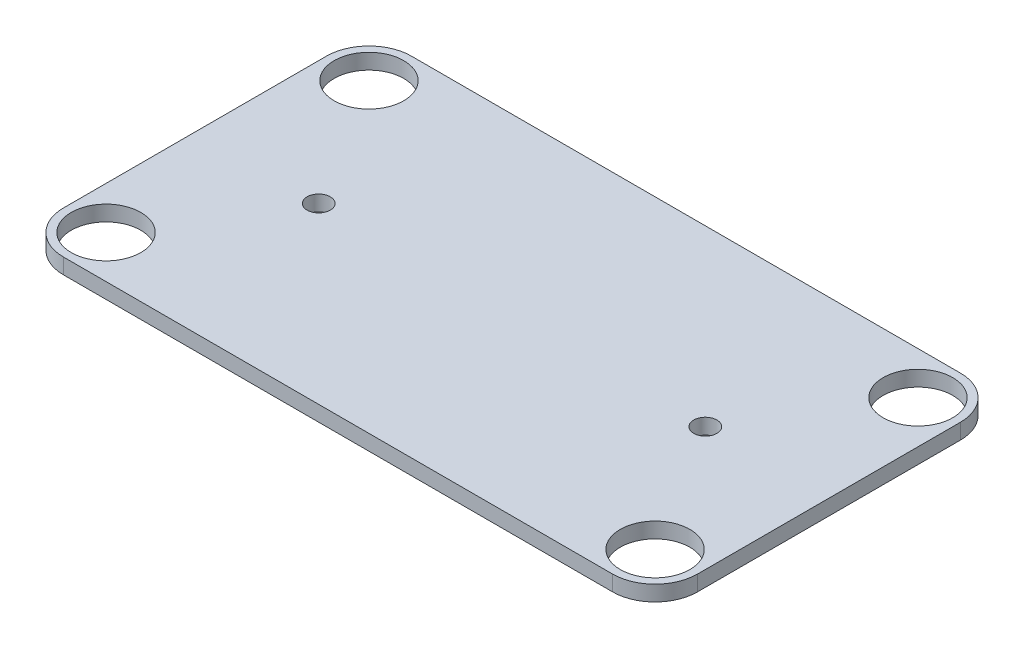
ISO-10303-21;
HEADER;
FILE_DESCRIPTION(('STEP AP214'),'2;1');
FILE_NAME('part.step','',(''),(''),'','','');
FILE_SCHEMA(('AUTOMOTIVE_DESIGN { 1 0 10303 214 1 1 1 1 }'));
ENDSEC;
DATA;
#1=APPLICATION_CONTEXT('core data for automotive mechanical design processes');
#2=APPLICATION_PROTOCOL_DEFINITION('international standard','automotive_design',2000,#1);
#3=PRODUCT_CONTEXT('',#1,'mechanical');
#4=PRODUCT('Part','Part','',(#3));
#5=PRODUCT_RELATED_PRODUCT_CATEGORY('part','',(#4));
#6=PRODUCT_DEFINITION_FORMATION('','',#4);
#7=PRODUCT_DEFINITION_CONTEXT('part definition',#1,'design');
#8=PRODUCT_DEFINITION('design','',#6,#7);
#9=PRODUCT_DEFINITION_SHAPE('','',#8);
#10=(LENGTH_UNIT() NAMED_UNIT(*) SI_UNIT(.MILLI.,.METRE.));
#11=(NAMED_UNIT(*) PLANE_ANGLE_UNIT() SI_UNIT($,.RADIAN.));
#12=(NAMED_UNIT(*) SI_UNIT($,.STERADIAN.) SOLID_ANGLE_UNIT());
#13=UNCERTAINTY_MEASURE_WITH_UNIT(LENGTH_MEASURE(1.E-05),#10,'distance_accuracy_value','');
#14=(GEOMETRIC_REPRESENTATION_CONTEXT(3) GLOBAL_UNCERTAINTY_ASSIGNED_CONTEXT((#13)) GLOBAL_UNIT_ASSIGNED_CONTEXT((#10,
#11,#12)) REPRESENTATION_CONTEXT('',''));
#15=CARTESIAN_POINT('',(0.,0.,0.));
#16=DIRECTION('',(0.,0.,1.));
#17=DIRECTION('',(1.,0.,0.));
#18=AXIS2_PLACEMENT_3D('',#15,#16,#17);
#19=CARTESIAN_POINT('',(-41.,2.,22.5));
#20=DIRECTION('',(0.,1.,0.));
#21=DIRECTION('',(0.,0.,1.));
#22=AXIS2_PLACEMENT_3D('',#19,#20,#21);
#23=PLANE('',#22);
#24=CARTESIAN_POINT('',(-25.,2.,0.));
#25=DIRECTION('',(0.,1.,0.));
#26=DIRECTION('',(0.,0.,1.));
#27=AXIS2_PLACEMENT_3D('',#24,#25,#26);
#28=CIRCLE('',#27,1.5);
#29=CARTESIAN_POINT('',(-25.,2.,1.5));
#30=VERTEX_POINT('',#29);
#31=EDGE_CURVE('E198',#30,#30,#28,.T.);
#32=ORIENTED_EDGE('',*,*,#31,.F.);
#33=EDGE_LOOP('',(#32));
#34=FACE_BOUND('',#33,.T.);
#35=CARTESIAN_POINT('',(35.5,2.,17.));
#36=DIRECTION('',(0.,1.,0.));
#37=DIRECTION('',(0.,0.,1.));
#38=AXIS2_PLACEMENT_3D('',#35,#36,#37);
#39=CIRCLE('',#38,4.5);
#40=CARTESIAN_POINT('',(35.5,2.,21.5));
#41=VERTEX_POINT('',#40);
#42=EDGE_CURVE('E186',#41,#41,#39,.T.);
#43=ORIENTED_EDGE('',*,*,#42,.F.);
#44=EDGE_LOOP('',(#43));
#45=FACE_BOUND('',#44,.T.);
#46=CARTESIAN_POINT('',(-35.5,2.,-17.));
#47=DIRECTION('',(0.,1.,0.));
#48=DIRECTION('',(0.,0.,1.));
#49=AXIS2_PLACEMENT_3D('',#46,#47,#48);
#50=CIRCLE('',#49,4.5);
#51=CARTESIAN_POINT('',(-35.5,2.,-12.5));
#52=VERTEX_POINT('',#51);
#53=EDGE_CURVE('E127',#52,#52,#50,.T.);
#54=ORIENTED_EDGE('',*,*,#53,.F.);
#55=EDGE_LOOP('',(#54));
#56=FACE_BOUND('',#55,.T.);
#57=DIRECTION('',(-1.,0.,0.));
#58=VECTOR('',#57,1.);
#59=CARTESIAN_POINT('',(-41.,2.,-22.5));
#60=LINE('',#59,#58);
#61=CARTESIAN_POINT('',(35.5,2.,-22.5));
#62=VERTEX_POINT('',#61);
#63=CARTESIAN_POINT('',(-35.5,2.,-22.5));
#64=VERTEX_POINT('',#63);
#65=EDGE_CURVE('E136',#62,#64,#60,.T.);
#66=ORIENTED_EDGE('',*,*,#65,.T.);
#67=CARTESIAN_POINT('',(-35.5,2.,-17.));
#68=DIRECTION('',(0.,1.,0.));
#69=DIRECTION('',(0.,0.,1.));
#70=AXIS2_PLACEMENT_3D('',#67,#68,#69);
#71=CIRCLE('',#70,5.5);
#72=CARTESIAN_POINT('',(-41.,2.,-17.));
#73=VERTEX_POINT('',#72);
#74=EDGE_CURVE('E155',#64,#73,#71,.T.);
#75=ORIENTED_EDGE('',*,*,#74,.T.);
#76=DIRECTION('',(0.,0.,1.));
#77=VECTOR('',#76,1.);
#78=CARTESIAN_POINT('',(-41.,2.,-22.5));
#79=LINE('',#78,#77);
#80=CARTESIAN_POINT('',(-41.,2.,17.));
#81=VERTEX_POINT('',#80);
#82=EDGE_CURVE('E119',#73,#81,#79,.T.);
#83=ORIENTED_EDGE('',*,*,#82,.T.);
#84=CARTESIAN_POINT('',(-35.5,2.,17.));
#85=DIRECTION('',(0.,1.,0.));
#86=DIRECTION('',(0.,0.,1.));
#87=AXIS2_PLACEMENT_3D('',#84,#85,#86);
#88=CIRCLE('',#87,5.5);
#89=CARTESIAN_POINT('',(-35.5,2.,22.5));
#90=VERTEX_POINT('',#89);
#91=EDGE_CURVE('E150',#81,#90,#88,.T.);
#92=ORIENTED_EDGE('',*,*,#91,.T.);
#93=DIRECTION('',(1.,0.,0.));
#94=VECTOR('',#93,1.);
#95=CARTESIAN_POINT('',(-41.,2.,22.5));
#96=LINE('',#95,#94);
#97=CARTESIAN_POINT('',(35.5,2.,22.5));
#98=VERTEX_POINT('',#97);
#99=EDGE_CURVE('E166',#90,#98,#96,.T.);
#100=ORIENTED_EDGE('',*,*,#99,.T.);
#101=CARTESIAN_POINT('',(35.5,2.,17.));
#102=DIRECTION('',(0.,1.,0.));
#103=DIRECTION('',(0.,0.,1.));
#104=AXIS2_PLACEMENT_3D('',#101,#102,#103);
#105=CIRCLE('',#104,5.5);
#106=CARTESIAN_POINT('',(41.,2.,17.));
#107=VERTEX_POINT('',#106);
#108=EDGE_CURVE('E55',#98,#107,#105,.T.);
#109=ORIENTED_EDGE('',*,*,#108,.T.);
#110=DIRECTION('',(0.,0.,-1.));
#111=VECTOR('',#110,1.);
#112=CARTESIAN_POINT('',(41.,2.,-22.5));
#113=LINE('',#112,#111);
#114=CARTESIAN_POINT('',(41.,2.,-17.));
#115=VERTEX_POINT('',#114);
#116=EDGE_CURVE('E174',#107,#115,#113,.T.);
#117=ORIENTED_EDGE('',*,*,#116,.T.);
#118=CARTESIAN_POINT('',(35.5,2.,-17.));
#119=DIRECTION('',(0.,1.,0.));
#120=DIRECTION('',(0.,0.,1.));
#121=AXIS2_PLACEMENT_3D('',#118,#119,#120);
#122=CIRCLE('',#121,5.5);
#123=EDGE_CURVE('E153',#115,#62,#122,.T.);
#124=ORIENTED_EDGE('',*,*,#123,.T.);
#125=EDGE_LOOP('',(#66,#75,#83,#92,#100,#109,#117,#124));
#126=FACE_BOUND('',#125,.T.);
#127=CARTESIAN_POINT('',(35.5,2.,-17.));
#128=DIRECTION('',(0.,1.,0.));
#129=DIRECTION('',(0.,0.,1.));
#130=AXIS2_PLACEMENT_3D('',#127,#128,#129);
#131=CIRCLE('',#130,4.5);
#132=CARTESIAN_POINT('',(35.5,2.,-12.5));
#133=VERTEX_POINT('',#132);
#134=EDGE_CURVE('E181',#133,#133,#131,.T.);
#135=ORIENTED_EDGE('',*,*,#134,.F.);
#136=EDGE_LOOP('',(#135));
#137=FACE_BOUND('',#136,.T.);
#138=CARTESIAN_POINT('',(-35.5,2.,17.));
#139=DIRECTION('',(0.,1.,0.));
#140=DIRECTION('',(0.,0.,1.));
#141=AXIS2_PLACEMENT_3D('',#138,#139,#140);
#142=CIRCLE('',#141,4.5);
#143=CARTESIAN_POINT('',(-35.5,2.,21.5));
#144=VERTEX_POINT('',#143);
#145=EDGE_CURVE('E192',#144,#144,#142,.T.);
#146=ORIENTED_EDGE('',*,*,#145,.F.);
#147=EDGE_LOOP('',(#146));
#148=FACE_BOUND('',#147,.T.);
#149=CARTESIAN_POINT('',(25.,2.,0.));
#150=DIRECTION('',(0.,1.,0.));
#151=DIRECTION('',(0.,0.,1.));
#152=AXIS2_PLACEMENT_3D('',#149,#150,#151);
#153=CIRCLE('',#152,1.5);
#154=CARTESIAN_POINT('',(25.,2.,1.5));
#155=VERTEX_POINT('',#154);
#156=EDGE_CURVE('E204',#155,#155,#153,.T.);
#157=ORIENTED_EDGE('',*,*,#156,.F.);
#158=EDGE_LOOP('',(#157));
#159=FACE_BOUND('',#158,.T.);
#160=ADVANCED_FACE('F33',(#34,#45,#56,#126,#137,#148,#159),#23,.T.);
#161=CARTESIAN_POINT('',(-41.,0.,22.5));
#162=DIRECTION('',(0.,1.,0.));
#163=DIRECTION('',(0.,0.,1.));
#164=AXIS2_PLACEMENT_3D('',#161,#162,#163);
#165=PLANE('',#164);
#166=CARTESIAN_POINT('',(-25.,0.,0.));
#167=DIRECTION('',(0.,1.,0.));
#168=DIRECTION('',(0.,0.,1.));
#169=AXIS2_PLACEMENT_3D('',#166,#167,#168);
#170=CIRCLE('',#169,1.5);
#171=CARTESIAN_POINT('',(-25.,0.,1.5));
#172=VERTEX_POINT('',#171);
#173=EDGE_CURVE('E201',#172,#172,#170,.T.);
#174=ORIENTED_EDGE('',*,*,#173,.T.);
#175=EDGE_LOOP('',(#174));
#176=FACE_BOUND('',#175,.T.);
#177=CARTESIAN_POINT('',(35.5,0.,17.));
#178=DIRECTION('',(0.,1.,0.));
#179=DIRECTION('',(0.,0.,1.));
#180=AXIS2_PLACEMENT_3D('',#177,#178,#179);
#181=CIRCLE('',#180,4.5);
#182=CARTESIAN_POINT('',(35.5,0.,21.5));
#183=VERTEX_POINT('',#182);
#184=EDGE_CURVE('E189',#183,#183,#181,.T.);
#185=ORIENTED_EDGE('',*,*,#184,.T.);
#186=EDGE_LOOP('',(#185));
#187=FACE_BOUND('',#186,.T.);
#188=CARTESIAN_POINT('',(-35.5,0.,-17.));
#189=DIRECTION('',(0.,1.,0.));
#190=DIRECTION('',(0.,0.,1.));
#191=AXIS2_PLACEMENT_3D('',#188,#189,#190);
#192=CIRCLE('',#191,4.5);
#193=CARTESIAN_POINT('',(-35.5,0.,-12.5));
#194=VERTEX_POINT('',#193);
#195=EDGE_CURVE('E133',#194,#194,#192,.T.);
#196=ORIENTED_EDGE('',*,*,#195,.T.);
#197=EDGE_LOOP('',(#196));
#198=FACE_BOUND('',#197,.T.);
#199=DIRECTION('',(0.,0.,1.));
#200=VECTOR('',#199,1.);
#201=CARTESIAN_POINT('',(-41.,0.,-22.5));
#202=LINE('',#201,#200);
#203=CARTESIAN_POINT('',(-41.,0.,-17.));
#204=VERTEX_POINT('',#203);
#205=CARTESIAN_POINT('',(-41.,0.,17.));
#206=VERTEX_POINT('',#205);
#207=EDGE_CURVE('E116',#204,#206,#202,.T.);
#208=ORIENTED_EDGE('',*,*,#207,.F.);
#209=CARTESIAN_POINT('',(-35.5,0.,-17.));
#210=DIRECTION('',(0.,1.,0.));
#211=DIRECTION('',(0.,0.,1.));
#212=AXIS2_PLACEMENT_3D('',#209,#210,#211);
#213=CIRCLE('',#212,5.5);
#214=CARTESIAN_POINT('',(-35.5,0.,-22.5));
#215=VERTEX_POINT('',#214);
#216=EDGE_CURVE('E99',#204,#215,#213,.F.);
#217=ORIENTED_EDGE('',*,*,#216,.T.);
#218=DIRECTION('',(-1.,0.,0.));
#219=VECTOR('',#218,1.);
#220=CARTESIAN_POINT('',(-41.,0.,-22.5));
#221=LINE('',#220,#219);
#222=CARTESIAN_POINT('',(35.5,0.,-22.5));
#223=VERTEX_POINT('',#222);
#224=EDGE_CURVE('E140',#223,#215,#221,.T.);
#225=ORIENTED_EDGE('',*,*,#224,.F.);
#226=CARTESIAN_POINT('',(35.5,0.,-17.));
#227=DIRECTION('',(0.,1.,0.));
#228=DIRECTION('',(0.,0.,1.));
#229=AXIS2_PLACEMENT_3D('',#226,#227,#228);
#230=CIRCLE('',#229,5.5);
#231=CARTESIAN_POINT('',(41.,0.,-17.));
#232=VERTEX_POINT('',#231);
#233=EDGE_CURVE('E110',#223,#232,#230,.F.);
#234=ORIENTED_EDGE('',*,*,#233,.T.);
#235=DIRECTION('',(0.,0.,-1.));
#236=VECTOR('',#235,1.);
#237=CARTESIAN_POINT('',(41.,0.,-22.5));
#238=LINE('',#237,#236);
#239=CARTESIAN_POINT('',(41.,0.,17.));
#240=VERTEX_POINT('',#239);
#241=EDGE_CURVE('E130',#240,#232,#238,.T.);
#242=ORIENTED_EDGE('',*,*,#241,.F.);
#243=CARTESIAN_POINT('',(35.5,0.,17.));
#244=DIRECTION('',(0.,1.,0.));
#245=DIRECTION('',(0.,0.,1.));
#246=AXIS2_PLACEMENT_3D('',#243,#244,#245);
#247=CIRCLE('',#246,5.5);
#248=CARTESIAN_POINT('',(35.5,0.,22.5));
#249=VERTEX_POINT('',#248);
#250=EDGE_CURVE('E144',#240,#249,#247,.F.);
#251=ORIENTED_EDGE('',*,*,#250,.T.);
#252=DIRECTION('',(1.,0.,0.));
#253=VECTOR('',#252,1.);
#254=CARTESIAN_POINT('',(-41.,0.,22.5));
#255=LINE('',#254,#253);
#256=CARTESIAN_POINT('',(-35.5,0.,22.5));
#257=VERTEX_POINT('',#256);
#258=EDGE_CURVE('E126',#257,#249,#255,.T.);
#259=ORIENTED_EDGE('',*,*,#258,.F.);
#260=CARTESIAN_POINT('',(-35.5,0.,17.));
#261=DIRECTION('',(0.,1.,0.));
#262=DIRECTION('',(0.,0.,1.));
#263=AXIS2_PLACEMENT_3D('',#260,#261,#262);
#264=CIRCLE('',#263,5.5);
#265=EDGE_CURVE('E120',#257,#206,#264,.F.);
#266=ORIENTED_EDGE('',*,*,#265,.T.);
#267=EDGE_LOOP('',(#208,#217,#225,#234,#242,#251,#259,#266));
#268=FACE_BOUND('',#267,.T.);
#269=CARTESIAN_POINT('',(35.5,0.,-17.));
#270=DIRECTION('',(0.,1.,0.));
#271=DIRECTION('',(0.,0.,1.));
#272=AXIS2_PLACEMENT_3D('',#269,#270,#271);
#273=CIRCLE('',#272,4.5);
#274=CARTESIAN_POINT('',(35.5,0.,-12.5));
#275=VERTEX_POINT('',#274);
#276=EDGE_CURVE('E183',#275,#275,#273,.T.);
#277=ORIENTED_EDGE('',*,*,#276,.T.);
#278=EDGE_LOOP('',(#277));
#279=FACE_BOUND('',#278,.T.);
#280=CARTESIAN_POINT('',(-35.5,0.,17.));
#281=DIRECTION('',(0.,1.,0.));
#282=DIRECTION('',(0.,0.,1.));
#283=AXIS2_PLACEMENT_3D('',#280,#281,#282);
#284=CIRCLE('',#283,4.5);
#285=CARTESIAN_POINT('',(-35.5,0.,21.5));
#286=VERTEX_POINT('',#285);
#287=EDGE_CURVE('E195',#286,#286,#284,.T.);
#288=ORIENTED_EDGE('',*,*,#287,.T.);
#289=EDGE_LOOP('',(#288));
#290=FACE_BOUND('',#289,.T.);
#291=CARTESIAN_POINT('',(25.,0.,0.));
#292=DIRECTION('',(0.,1.,0.));
#293=DIRECTION('',(0.,0.,1.));
#294=AXIS2_PLACEMENT_3D('',#291,#292,#293);
#295=CIRCLE('',#294,1.5);
#296=CARTESIAN_POINT('',(25.,0.,1.5));
#297=VERTEX_POINT('',#296);
#298=EDGE_CURVE('E207',#297,#297,#295,.T.);
#299=ORIENTED_EDGE('',*,*,#298,.T.);
#300=EDGE_LOOP('',(#299));
#301=FACE_BOUND('',#300,.T.);
#302=ADVANCED_FACE('F123',(#176,#187,#198,#268,#279,#290,#301),#165,.F.);
#303=CARTESIAN_POINT('',(-41.,2.,-22.5));
#304=DIRECTION('',(1.,0.,0.));
#305=DIRECTION('',(0.,0.,-1.));
#306=AXIS2_PLACEMENT_3D('',#303,#304,#305);
#307=PLANE('',#306);
#308=ORIENTED_EDGE('',*,*,#82,.F.);
#309=DIRECTION('',(0.,-1.,0.));
#310=VECTOR('',#309,1.);
#311=CARTESIAN_POINT('',(-41.,2.,-17.));
#312=LINE('',#311,#310);
#313=EDGE_CURVE('E103',#73,#204,#312,.T.);
#314=ORIENTED_EDGE('',*,*,#313,.T.);
#315=ORIENTED_EDGE('',*,*,#207,.T.);
#316=DIRECTION('',(0.,-1.,0.));
#317=VECTOR('',#316,1.);
#318=CARTESIAN_POINT('',(-41.,2.,17.));
#319=LINE('',#318,#317);
#320=EDGE_CURVE('E121',#206,#81,#319,.F.);
#321=ORIENTED_EDGE('',*,*,#320,.T.);
#322=EDGE_LOOP('',(#308,#314,#315,#321));
#323=FACE_BOUND('',#322,.T.);
#324=ADVANCED_FACE('F115',(#323),#307,.F.);
#325=CARTESIAN_POINT('',(-41.,2.,22.5));
#326=DIRECTION('',(0.,0.,-1.));
#327=DIRECTION('',(-1.,0.,0.));
#328=AXIS2_PLACEMENT_3D('',#325,#326,#327);
#329=PLANE('',#328);
#330=ORIENTED_EDGE('',*,*,#258,.T.);
#331=DIRECTION('',(0.,-1.,0.));
#332=VECTOR('',#331,1.);
#333=CARTESIAN_POINT('',(35.5,2.,22.5));
#334=LINE('',#333,#332);
#335=EDGE_CURVE('E11',#249,#98,#334,.F.);
#336=ORIENTED_EDGE('',*,*,#335,.T.);
#337=ORIENTED_EDGE('',*,*,#99,.F.);
#338=DIRECTION('',(0.,-1.,0.));
#339=VECTOR('',#338,1.);
#340=CARTESIAN_POINT('',(-35.5,2.,22.5));
#341=LINE('',#340,#339);
#342=EDGE_CURVE('E41',#90,#257,#341,.T.);
#343=ORIENTED_EDGE('',*,*,#342,.T.);
#344=EDGE_LOOP('',(#330,#336,#337,#343));
#345=FACE_BOUND('',#344,.T.);
#346=ADVANCED_FACE('F164',(#345),#329,.F.);
#347=CARTESIAN_POINT('',(41.,2.,-22.5));
#348=DIRECTION('',(-1.,0.,0.));
#349=DIRECTION('',(0.,0.,1.));
#350=AXIS2_PLACEMENT_3D('',#347,#348,#349);
#351=PLANE('',#350);
#352=ORIENTED_EDGE('',*,*,#241,.T.);
#353=DIRECTION('',(0.,-1.,0.));
#354=VECTOR('',#353,1.);
#355=CARTESIAN_POINT('',(41.,2.,-17.));
#356=LINE('',#355,#354);
#357=EDGE_CURVE('E48',#232,#115,#356,.F.);
#358=ORIENTED_EDGE('',*,*,#357,.T.);
#359=ORIENTED_EDGE('',*,*,#116,.F.);
#360=DIRECTION('',(0.,-1.,0.));
#361=VECTOR('',#360,1.);
#362=CARTESIAN_POINT('',(41.,2.,17.));
#363=LINE('',#362,#361);
#364=EDGE_CURVE('E157',#107,#240,#363,.T.);
#365=ORIENTED_EDGE('',*,*,#364,.T.);
#366=EDGE_LOOP('',(#352,#358,#359,#365));
#367=FACE_BOUND('',#366,.T.);
#368=ADVANCED_FACE('F173',(#367),#351,.F.);
#369=CARTESIAN_POINT('',(-41.,2.,-22.5));
#370=DIRECTION('',(0.,0.,1.));
#371=DIRECTION('',(1.,0.,0.));
#372=AXIS2_PLACEMENT_3D('',#369,#370,#371);
#373=PLANE('',#372);
#374=ORIENTED_EDGE('',*,*,#224,.T.);
#375=DIRECTION('',(0.,-1.,0.));
#376=VECTOR('',#375,1.);
#377=CARTESIAN_POINT('',(-35.5,2.,-22.5));
#378=LINE('',#377,#376);
#379=EDGE_CURVE('E104',#215,#64,#378,.F.);
#380=ORIENTED_EDGE('',*,*,#379,.T.);
#381=ORIENTED_EDGE('',*,*,#65,.F.);
#382=DIRECTION('',(0.,-1.,0.));
#383=VECTOR('',#382,1.);
#384=CARTESIAN_POINT('',(35.5,2.,-22.5));
#385=LINE('',#384,#383);
#386=EDGE_CURVE('E109',#62,#223,#385,.T.);
#387=ORIENTED_EDGE('',*,*,#386,.T.);
#388=EDGE_LOOP('',(#374,#380,#381,#387));
#389=FACE_BOUND('',#388,.T.);
#390=ADVANCED_FACE('F230',(#389),#373,.F.);
#391=CARTESIAN_POINT('',(-35.5,2.,-17.));
#392=DIRECTION('',(0.,-1.,0.));
#393=DIRECTION('',(0.,0.,-1.));
#394=AXIS2_PLACEMENT_3D('',#391,#392,#393);
#395=CYLINDRICAL_SURFACE('',#394,4.5);
#396=ORIENTED_EDGE('',*,*,#53,.T.);
#397=EDGE_LOOP('',(#396));
#398=FACE_BOUND('',#397,.T.);
#399=ORIENTED_EDGE('',*,*,#195,.F.);
#400=EDGE_LOOP('',(#399));
#401=FACE_BOUND('',#400,.T.);
#402=ADVANCED_FACE('F227',(#398,#401),#395,.F.);
#403=CARTESIAN_POINT('',(35.5,2.,-17.));
#404=DIRECTION('',(0.,-1.,0.));
#405=DIRECTION('',(0.,0.,-1.));
#406=AXIS2_PLACEMENT_3D('',#403,#404,#405);
#407=CYLINDRICAL_SURFACE('',#406,4.5);
#408=ORIENTED_EDGE('',*,*,#134,.T.);
#409=EDGE_LOOP('',(#408));
#410=FACE_BOUND('',#409,.T.);
#411=ORIENTED_EDGE('',*,*,#276,.F.);
#412=EDGE_LOOP('',(#411));
#413=FACE_BOUND('',#412,.T.);
#414=ADVANCED_FACE('F277',(#410,#413),#407,.F.);
#415=CARTESIAN_POINT('',(35.5,2.,17.));
#416=DIRECTION('',(0.,-1.,0.));
#417=DIRECTION('',(0.,0.,-1.));
#418=AXIS2_PLACEMENT_3D('',#415,#416,#417);
#419=CYLINDRICAL_SURFACE('',#418,4.5);
#420=ORIENTED_EDGE('',*,*,#42,.T.);
#421=EDGE_LOOP('',(#420));
#422=FACE_BOUND('',#421,.T.);
#423=ORIENTED_EDGE('',*,*,#184,.F.);
#424=EDGE_LOOP('',(#423));
#425=FACE_BOUND('',#424,.T.);
#426=ADVANCED_FACE('F262',(#422,#425),#419,.F.);
#427=CARTESIAN_POINT('',(-35.5,2.,17.));
#428=DIRECTION('',(0.,-1.,0.));
#429=DIRECTION('',(0.,0.,-1.));
#430=AXIS2_PLACEMENT_3D('',#427,#428,#429);
#431=CYLINDRICAL_SURFACE('',#430,4.5);
#432=ORIENTED_EDGE('',*,*,#145,.T.);
#433=EDGE_LOOP('',(#432));
#434=FACE_BOUND('',#433,.T.);
#435=ORIENTED_EDGE('',*,*,#287,.F.);
#436=EDGE_LOOP('',(#435));
#437=FACE_BOUND('',#436,.T.);
#438=ADVANCED_FACE('F258',(#434,#437),#431,.F.);
#439=CARTESIAN_POINT('',(-25.,2.,0.));
#440=DIRECTION('',(0.,-1.,0.));
#441=DIRECTION('',(0.,0.,-1.));
#442=AXIS2_PLACEMENT_3D('',#439,#440,#441);
#443=CYLINDRICAL_SURFACE('',#442,1.5);
#444=ORIENTED_EDGE('',*,*,#31,.T.);
#445=EDGE_LOOP('',(#444));
#446=FACE_BOUND('',#445,.T.);
#447=ORIENTED_EDGE('',*,*,#173,.F.);
#448=EDGE_LOOP('',(#447));
#449=FACE_BOUND('',#448,.T.);
#450=ADVANCED_FACE('F261',(#446,#449),#443,.F.);
#451=CARTESIAN_POINT('',(25.,2.,0.));
#452=DIRECTION('',(0.,-1.,0.));
#453=DIRECTION('',(0.,0.,-1.));
#454=AXIS2_PLACEMENT_3D('',#451,#452,#453);
#455=CYLINDRICAL_SURFACE('',#454,1.5);
#456=ORIENTED_EDGE('',*,*,#156,.T.);
#457=EDGE_LOOP('',(#456));
#458=FACE_BOUND('',#457,.T.);
#459=ORIENTED_EDGE('',*,*,#298,.F.);
#460=EDGE_LOOP('',(#459));
#461=FACE_BOUND('',#460,.T.);
#462=ADVANCED_FACE('F213',(#458,#461),#455,.F.);
#463=CARTESIAN_POINT('',(-35.5,2.,-17.));
#464=DIRECTION('',(0.,-1.,0.));
#465=DIRECTION('',(0.,0.,-1.));
#466=AXIS2_PLACEMENT_3D('',#463,#464,#465);
#467=CYLINDRICAL_SURFACE('',#466,5.5);
#468=ORIENTED_EDGE('',*,*,#74,.F.);
#469=ORIENTED_EDGE('',*,*,#379,.F.);
#470=ORIENTED_EDGE('',*,*,#216,.F.);
#471=ORIENTED_EDGE('',*,*,#313,.F.);
#472=EDGE_LOOP('',(#468,#469,#470,#471));
#473=FACE_BOUND('',#472,.T.);
#474=ADVANCED_FACE('F102',(#473),#467,.T.);
#475=CARTESIAN_POINT('',(35.5,2.,-17.));
#476=DIRECTION('',(0.,-1.,0.));
#477=DIRECTION('',(0.,0.,-1.));
#478=AXIS2_PLACEMENT_3D('',#475,#476,#477);
#479=CYLINDRICAL_SURFACE('',#478,5.5);
#480=ORIENTED_EDGE('',*,*,#123,.F.);
#481=ORIENTED_EDGE('',*,*,#357,.F.);
#482=ORIENTED_EDGE('',*,*,#233,.F.);
#483=ORIENTED_EDGE('',*,*,#386,.F.);
#484=EDGE_LOOP('',(#480,#481,#482,#483));
#485=FACE_BOUND('',#484,.T.);
#486=ADVANCED_FACE('F242',(#485),#479,.T.);
#487=CARTESIAN_POINT('',(35.5,2.,17.));
#488=DIRECTION('',(0.,-1.,0.));
#489=DIRECTION('',(0.,0.,-1.));
#490=AXIS2_PLACEMENT_3D('',#487,#488,#489);
#491=CYLINDRICAL_SURFACE('',#490,5.5);
#492=ORIENTED_EDGE('',*,*,#108,.F.);
#493=ORIENTED_EDGE('',*,*,#335,.F.);
#494=ORIENTED_EDGE('',*,*,#250,.F.);
#495=ORIENTED_EDGE('',*,*,#364,.F.);
#496=EDGE_LOOP('',(#492,#493,#494,#495));
#497=FACE_BOUND('',#496,.T.);
#498=ADVANCED_FACE('F172',(#497),#491,.T.);
#499=CARTESIAN_POINT('',(-35.5,2.,17.));
#500=DIRECTION('',(0.,-1.,0.));
#501=DIRECTION('',(0.,0.,-1.));
#502=AXIS2_PLACEMENT_3D('',#499,#500,#501);
#503=CYLINDRICAL_SURFACE('',#502,5.5);
#504=ORIENTED_EDGE('',*,*,#91,.F.);
#505=ORIENTED_EDGE('',*,*,#320,.F.);
#506=ORIENTED_EDGE('',*,*,#265,.F.);
#507=ORIENTED_EDGE('',*,*,#342,.F.);
#508=EDGE_LOOP('',(#504,#505,#506,#507));
#509=FACE_BOUND('',#508,.T.);
#510=ADVANCED_FACE('F35',(#509),#503,.T.);
#511=CLOSED_SHELL('',(#160,#302,#324,#346,#368,#390,#402,#414,#426,#438,#450,#462,#474,#486,
#498,#510));
#512=MANIFOLD_SOLID_BREP('B2',#511);
#513=ADVANCED_BREP_SHAPE_REPRESENTATION('',(#18,#512),#14);
#514=SHAPE_DEFINITION_REPRESENTATION(#9,#513);
ENDSEC;
END-ISO-10303-21;
